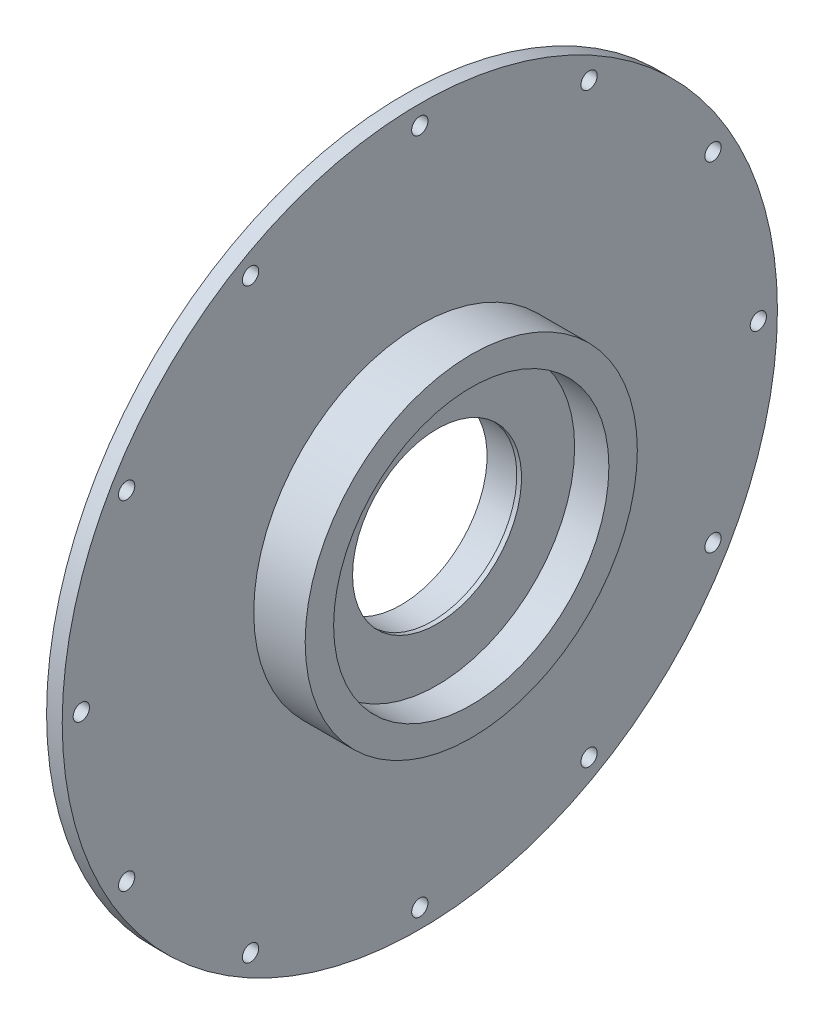
ISO-10303-21;
HEADER;
FILE_DESCRIPTION(('STEP AP214'),'2;1');
FILE_NAME('part.step','',(''),(''),'','','');
FILE_SCHEMA(('AUTOMOTIVE_DESIGN { 1 0 10303 214 1 1 1 1 }'));
ENDSEC;
DATA;
#1=APPLICATION_CONTEXT('core data for automotive mechanical design processes');
#2=APPLICATION_PROTOCOL_DEFINITION('international standard','automotive_design',2000,#1);
#3=PRODUCT_CONTEXT('',#1,'mechanical');
#4=PRODUCT('Part','Part','',(#3));
#5=PRODUCT_RELATED_PRODUCT_CATEGORY('part','',(#4));
#6=PRODUCT_DEFINITION_FORMATION('','',#4);
#7=PRODUCT_DEFINITION_CONTEXT('part definition',#1,'design');
#8=PRODUCT_DEFINITION('design','',#6,#7);
#9=PRODUCT_DEFINITION_SHAPE('','',#8);
#10=(LENGTH_UNIT() NAMED_UNIT(*) SI_UNIT(.MILLI.,.METRE.));
#11=(NAMED_UNIT(*) PLANE_ANGLE_UNIT() SI_UNIT($,.RADIAN.));
#12=(NAMED_UNIT(*) SI_UNIT($,.STERADIAN.) SOLID_ANGLE_UNIT());
#13=UNCERTAINTY_MEASURE_WITH_UNIT(LENGTH_MEASURE(1.E-05),#10,'distance_accuracy_value','');
#14=(GEOMETRIC_REPRESENTATION_CONTEXT(3) GLOBAL_UNCERTAINTY_ASSIGNED_CONTEXT((#13)) GLOBAL_UNIT_ASSIGNED_CONTEXT((#10,
#11,#12)) REPRESENTATION_CONTEXT('',''));
#15=CARTESIAN_POINT('',(0.,0.,0.));
#16=DIRECTION('',(0.,0.,1.));
#17=DIRECTION('',(1.,0.,0.));
#18=AXIS2_PLACEMENT_3D('',#15,#16,#17);
#19=CARTESIAN_POINT('',(0.,27.5,0.));
#20=DIRECTION('',(1.,0.,0.));
#21=DIRECTION('',(0.,0.,-1.));
#22=AXIS2_PLACEMENT_3D('',#19,#20,#21);
#23=PLANE('',#22);
#24=CARTESIAN_POINT('',(0.,0.,0.));
#25=DIRECTION('',(-1.,0.,0.));
#26=DIRECTION('',(0.,0.,1.));
#27=AXIS2_PLACEMENT_3D('',#24,#25,#26);
#28=CIRCLE('',#27,27.5);
#29=CARTESIAN_POINT('',(0.,0.,27.5));
#30=VERTEX_POINT('',#29);
#31=EDGE_CURVE('E124',#30,#30,#28,.T.);
#32=ORIENTED_EDGE('',*,*,#31,.F.);
#33=EDGE_LOOP('',(#32));
#34=FACE_BOUND('',#33,.T.);
#35=CARTESIAN_POINT('',(0.,0.,0.));
#36=DIRECTION('',(-1.,0.,0.));
#37=DIRECTION('',(0.,0.,1.));
#38=AXIS2_PLACEMENT_3D('',#35,#36,#37);
#39=CIRCLE('',#38,35.2294888080078);
#40=CARTESIAN_POINT('',(0.,0.,35.2294888080078));
#41=VERTEX_POINT('',#40);
#42=EDGE_CURVE('E10',#41,#41,#39,.T.);
#43=ORIENTED_EDGE('',*,*,#42,.T.);
#44=EDGE_LOOP('',(#43));
#45=FACE_BOUND('',#44,.T.);
#46=ADVANCED_FACE('F36',(#34,#45),#23,.F.);
#47=CARTESIAN_POINT('',(4.99999999999999,0.,0.));
#48=DIRECTION('',(1.,0.,0.));
#49=DIRECTION('',(0.,0.,-1.));
#50=AXIS2_PLACEMENT_3D('',#47,#48,#49);
#51=CONICAL_SURFACE('',#50,73.23,1.43997067062973);
#52=ORIENTED_EDGE('',*,*,#42,.F.);
#53=EDGE_LOOP('',(#52));
#54=FACE_BOUND('',#53,.T.);
#55=CARTESIAN_POINT('',(4.99999999999999,0.,0.));
#56=DIRECTION('',(-1.,0.,0.));
#57=DIRECTION('',(0.,0.,1.));
#58=AXIS2_PLACEMENT_3D('',#55,#56,#57);
#59=CIRCLE('',#58,73.23);
#60=CARTESIAN_POINT('',(4.99999999999999,0.,73.23));
#61=VERTEX_POINT('',#60);
#62=EDGE_CURVE('E44',#61,#61,#59,.T.);
#63=ORIENTED_EDGE('',*,*,#62,.T.);
#64=EDGE_LOOP('',(#63));
#65=FACE_BOUND('',#64,.T.);
#66=ADVANCED_FACE('F303',(#54,#65),#51,.T.);
#67=CARTESIAN_POINT('',(4.99999999999999,98.23,0.));
#68=DIRECTION('',(1.,0.,0.));
#69=DIRECTION('',(0.,0.,-1.));
#70=AXIS2_PLACEMENT_3D('',#67,#68,#69);
#71=PLANE('',#70);
#72=ORIENTED_EDGE('',*,*,#62,.F.);
#73=EDGE_LOOP('',(#72));
#74=FACE_BOUND('',#73,.T.);
#75=CARTESIAN_POINT('',(4.99999999999999,0.,0.));
#76=DIRECTION('',(-1.,0.,0.));
#77=DIRECTION('',(0.,0.,1.));
#78=AXIS2_PLACEMENT_3D('',#75,#76,#77);
#79=CIRCLE('',#78,98.23);
#80=CARTESIAN_POINT('',(4.99999999999999,0.,98.23));
#81=VERTEX_POINT('',#80);
#82=EDGE_CURVE('E50',#81,#81,#79,.T.);
#83=ORIENTED_EDGE('',*,*,#82,.T.);
#84=EDGE_LOOP('',(#83));
#85=FACE_BOUND('',#84,.T.);
#86=ADVANCED_FACE('F195',(#74,#85),#71,.F.);
#87=CARTESIAN_POINT('',(2.49999999999999,0.,0.));
#88=DIRECTION('',(-1.,0.,0.));
#89=DIRECTION('',(0.,0.,1.));
#90=AXIS2_PLACEMENT_3D('',#87,#88,#89);
#91=CONICAL_SURFACE('',#90,100.5,0.737217450629854);
#92=ORIENTED_EDGE('',*,*,#82,.F.);
#93=EDGE_LOOP('',(#92));
#94=FACE_BOUND('',#93,.T.);
#95=CARTESIAN_POINT('',(2.49999999999999,0.,0.));
#96=DIRECTION('',(-1.,0.,0.));
#97=DIRECTION('',(0.,0.,1.));
#98=AXIS2_PLACEMENT_3D('',#95,#96,#97);
#99=CIRCLE('',#98,100.5);
#100=CARTESIAN_POINT('',(2.49999999999999,0.,100.5));
#101=VERTEX_POINT('',#100);
#102=EDGE_CURVE('E188',#101,#101,#99,.T.);
#103=ORIENTED_EDGE('',*,*,#102,.T.);
#104=EDGE_LOOP('',(#103));
#105=FACE_BOUND('',#104,.T.);
#106=ADVANCED_FACE('F197',(#94,#105),#91,.F.);
#107=CARTESIAN_POINT('',(0.,0.,0.));
#108=DIRECTION('',(-1.,0.,0.));
#109=DIRECTION('',(0.,0.,1.));
#110=AXIS2_PLACEMENT_3D('',#107,#108,#109);
#111=CYLINDRICAL_SURFACE('',#110,100.5);
#112=ORIENTED_EDGE('',*,*,#102,.F.);
#113=EDGE_LOOP('',(#112));
#114=FACE_BOUND('',#113,.T.);
#115=CARTESIAN_POINT('',(-0.500000000000009,0.,0.));
#116=DIRECTION('',(-1.,0.,0.));
#117=DIRECTION('',(0.,0.,1.));
#118=AXIS2_PLACEMENT_3D('',#115,#116,#117);
#119=CIRCLE('',#118,100.5);
#120=CARTESIAN_POINT('',(-0.500000000000009,0.,100.5));
#121=VERTEX_POINT('',#120);
#122=EDGE_CURVE('E184',#121,#121,#119,.T.);
#123=ORIENTED_EDGE('',*,*,#122,.T.);
#124=EDGE_LOOP('',(#123));
#125=FACE_BOUND('',#124,.T.);
#126=ADVANCED_FACE('F200',(#114,#125),#111,.F.);
#127=CARTESIAN_POINT('',(-0.500000000000009,102.2,0.));
#128=DIRECTION('',(1.,0.,0.));
#129=DIRECTION('',(0.,0.,-1.));
#130=AXIS2_PLACEMENT_3D('',#127,#128,#129);
#131=PLANE('',#130);
#132=ORIENTED_EDGE('',*,*,#122,.F.);
#133=EDGE_LOOP('',(#132));
#134=FACE_BOUND('',#133,.T.);
#135=CARTESIAN_POINT('',(-0.500000000000009,0.,0.));
#136=DIRECTION('',(-1.,0.,0.));
#137=DIRECTION('',(0.,0.,1.));
#138=AXIS2_PLACEMENT_3D('',#135,#136,#137);
#139=CIRCLE('',#138,102.2);
#140=CARTESIAN_POINT('',(-0.500000000000009,0.,102.2));
#141=VERTEX_POINT('',#140);
#142=EDGE_CURVE('E180',#141,#141,#139,.T.);
#143=ORIENTED_EDGE('',*,*,#142,.T.);
#144=EDGE_LOOP('',(#143));
#145=FACE_BOUND('',#144,.T.);
#146=ADVANCED_FACE('F206',(#134,#145),#131,.F.);
#147=CARTESIAN_POINT('',(0.499999999999991,0.,0.));
#148=DIRECTION('',(1.,0.,0.));
#149=DIRECTION('',(0.,0.,-1.));
#150=AXIS2_PLACEMENT_3D('',#147,#148,#149);
#151=CONICAL_SURFACE('',#150,102.5,0.291456794477862);
#152=ORIENTED_EDGE('',*,*,#142,.F.);
#153=EDGE_LOOP('',(#152));
#154=FACE_BOUND('',#153,.T.);
#155=CARTESIAN_POINT('',(0.499999999999991,0.,0.));
#156=DIRECTION('',(-1.,0.,0.));
#157=DIRECTION('',(0.,0.,1.));
#158=AXIS2_PLACEMENT_3D('',#155,#156,#157);
#159=CIRCLE('',#158,102.5);
#160=CARTESIAN_POINT('',(0.499999999999991,0.,102.5));
#161=VERTEX_POINT('',#160);
#162=EDGE_CURVE('E176',#161,#161,#159,.T.);
#163=ORIENTED_EDGE('',*,*,#162,.T.);
#164=EDGE_LOOP('',(#163));
#165=FACE_BOUND('',#164,.T.);
#166=ADVANCED_FACE('F212',(#154,#165),#151,.T.);
#167=CARTESIAN_POINT('',(0.,0.,0.));
#168=DIRECTION('',(-1.,0.,0.));
#169=DIRECTION('',(0.,0.,1.));
#170=AXIS2_PLACEMENT_3D('',#167,#168,#169);
#171=CYLINDRICAL_SURFACE('',#170,102.5);
#172=ORIENTED_EDGE('',*,*,#162,.F.);
#173=EDGE_LOOP('',(#172));
#174=FACE_BOUND('',#173,.T.);
#175=CARTESIAN_POINT('',(2.49999999999999,0.,0.));
#176=DIRECTION('',(-1.,0.,0.));
#177=DIRECTION('',(0.,0.,1.));
#178=AXIS2_PLACEMENT_3D('',#175,#176,#177);
#179=CIRCLE('',#178,102.5);
#180=CARTESIAN_POINT('',(2.49999999999999,0.,102.5));
#181=VERTEX_POINT('',#180);
#182=EDGE_CURVE('E172',#181,#181,#179,.T.);
#183=ORIENTED_EDGE('',*,*,#182,.T.);
#184=EDGE_LOOP('',(#183));
#185=FACE_BOUND('',#184,.T.);
#186=ADVANCED_FACE('F218',(#174,#185),#171,.T.);
#187=CARTESIAN_POINT('',(2.49999999999999,102.5,0.));
#188=DIRECTION('',(1.,0.,0.));
#189=DIRECTION('',(0.,0.,-1.));
#190=AXIS2_PLACEMENT_3D('',#187,#188,#189);
#191=PLANE('',#190);
#192=ORIENTED_EDGE('',*,*,#182,.F.);
#193=EDGE_LOOP('',(#192));
#194=FACE_BOUND('',#193,.T.);
#195=CARTESIAN_POINT('',(2.49999999999999,0.,0.));
#196=DIRECTION('',(-1.,0.,0.));
#197=DIRECTION('',(0.,0.,1.));
#198=AXIS2_PLACEMENT_3D('',#195,#196,#197);
#199=CIRCLE('',#198,104.);
#200=CARTESIAN_POINT('',(2.49999999999999,0.,104.));
#201=VERTEX_POINT('',#200);
#202=EDGE_CURVE('E168',#201,#201,#199,.T.);
#203=ORIENTED_EDGE('',*,*,#202,.T.);
#204=EDGE_LOOP('',(#203));
#205=FACE_BOUND('',#204,.T.);
#206=ADVANCED_FACE('F224',(#194,#205),#191,.F.);
#207=CARTESIAN_POINT('',(0.,0.,0.));
#208=DIRECTION('',(-1.,0.,0.));
#209=DIRECTION('',(0.,0.,1.));
#210=AXIS2_PLACEMENT_3D('',#207,#208,#209);
#211=CYLINDRICAL_SURFACE('',#210,104.);
#212=ORIENTED_EDGE('',*,*,#202,.F.);
#213=EDGE_LOOP('',(#212));
#214=FACE_BOUND('',#213,.T.);
#215=CARTESIAN_POINT('',(0.99999999999999,0.,0.));
#216=DIRECTION('',(-1.,0.,0.));
#217=DIRECTION('',(0.,0.,1.));
#218=AXIS2_PLACEMENT_3D('',#215,#216,#217);
#219=CIRCLE('',#218,104.);
#220=CARTESIAN_POINT('',(0.99999999999999,0.,104.));
#221=VERTEX_POINT('',#220);
#222=EDGE_CURVE('E164',#221,#221,#219,.T.);
#223=ORIENTED_EDGE('',*,*,#222,.T.);
#224=EDGE_LOOP('',(#223));
#225=FACE_BOUND('',#224,.T.);
#226=ADVANCED_FACE('F230',(#214,#225),#211,.F.);
#227=CARTESIAN_POINT('',(0.99999999999999,104.,0.));
#228=DIRECTION('',(1.,0.,0.));
#229=DIRECTION('',(0.,0.,-1.));
#230=AXIS2_PLACEMENT_3D('',#227,#228,#229);
#231=PLANE('',#230);
#232=CARTESIAN_POINT('',(0.99999999999999,108.2,0.));
#233=DIRECTION('',(1.,0.,0.));
#234=DIRECTION('',(0.,0.,-1.));
#235=AXIS2_PLACEMENT_3D('',#232,#233,#234);
#236=CIRCLE('',#235,2.6);
#237=CARTESIAN_POINT('',(0.99999999999999,108.2,-2.6));
#238=VERTEX_POINT('',#237);
#239=EDGE_CURVE('E120',#238,#238,#236,.F.);
#240=ORIENTED_EDGE('',*,*,#239,.F.);
#241=EDGE_LOOP('',(#240));
#242=FACE_BOUND('',#241,.T.);
#243=CARTESIAN_POINT('',(0.99999999999999,93.7039486894732,54.0999999999992));
#244=DIRECTION('',(1.,0.,0.));
#245=DIRECTION('',(0.,0.,-1.));
#246=AXIS2_PLACEMENT_3D('',#243,#244,#245);
#247=CIRCLE('',#246,2.60000000000307);
#248=CARTESIAN_POINT('',(0.99999999999999,93.7039486894732,51.4999999999962));
#249=VERTEX_POINT('',#248);
#250=EDGE_CURVE('E106',#249,#249,#247,.F.);
#251=ORIENTED_EDGE('',*,*,#250,.F.);
#252=EDGE_LOOP('',(#251));
#253=FACE_BOUND('',#252,.T.);
#254=CARTESIAN_POINT('',(0.99999999999999,54.0999999999946,93.7039486894732));
#255=DIRECTION('',(1.,0.,0.));
#256=DIRECTION('',(0.,0.,-1.));
#257=AXIS2_PLACEMENT_3D('',#254,#255,#256);
#258=CIRCLE('',#257,2.60000000000576);
#259=CARTESIAN_POINT('',(0.99999999999999,54.0999999999946,91.1039486894675));
#260=VERTEX_POINT('',#259);
#261=EDGE_CURVE('E102',#260,#260,#258,.F.);
#262=ORIENTED_EDGE('',*,*,#261,.F.);
#263=EDGE_LOOP('',(#262));
#264=FACE_BOUND('',#263,.T.);
#265=CARTESIAN_POINT('',(0.99999999999999,-6.14383258155604E-12,108.199999999994));
#266=DIRECTION('',(1.,0.,0.));
#267=DIRECTION('',(0.,0.,-1.));
#268=AXIS2_PLACEMENT_3D('',#265,#266,#267);
#269=CIRCLE('',#268,2.60000000000875);
#270=CARTESIAN_POINT('',(0.99999999999999,-6.14383258155604E-12,105.599999999985));
#271=VERTEX_POINT('',#270);
#272=EDGE_CURVE('E98',#271,#271,#269,.F.);
#273=ORIENTED_EDGE('',*,*,#272,.F.);
#274=EDGE_LOOP('',(#273));
#275=FACE_BOUND('',#274,.T.);
#276=CARTESIAN_POINT('',(0.99999999999999,93.7039486894793,-54.1000000000008));
#277=DIRECTION('',(1.,0.,0.));
#278=DIRECTION('',(0.,0.,-1.));
#279=AXIS2_PLACEMENT_3D('',#276,#277,#278);
#280=CIRCLE('',#279,2.60000000000001);
#281=CARTESIAN_POINT('',(0.99999999999999,93.7039486894793,-56.7000000000008));
#282=VERTEX_POINT('',#281);
#283=EDGE_CURVE('E93',#282,#282,#280,.F.);
#284=ORIENTED_EDGE('',*,*,#283,.F.);
#285=EDGE_LOOP('',(#284));
#286=FACE_BOUND('',#285,.T.);
#287=CARTESIAN_POINT('',(0.99999999999999,54.1000000000053,-93.7039486894793));
#288=DIRECTION('',(1.,0.,0.));
#289=DIRECTION('',(0.,0.,-1.));
#290=AXIS2_PLACEMENT_3D('',#287,#288,#289);
#291=CIRCLE('',#290,2.60000000000162);
#292=CARTESIAN_POINT('',(0.99999999999999,54.1000000000053,-96.3039486894809));
#293=VERTEX_POINT('',#292);
#294=EDGE_CURVE('E88',#293,#293,#291,.F.);
#295=ORIENTED_EDGE('',*,*,#294,.F.);
#296=EDGE_LOOP('',(#295));
#297=FACE_BOUND('',#296,.T.);
#298=CARTESIAN_POINT('',(0.99999999999999,6.13058190318926E-12,-108.200000000006));
#299=DIRECTION('',(1.,0.,0.));
#300=DIRECTION('',(0.,0.,-1.));
#301=AXIS2_PLACEMENT_3D('',#298,#299,#300);
#302=CIRCLE('',#301,2.60000000000444);
#303=CARTESIAN_POINT('',(0.99999999999999,6.13058190318926E-12,-110.800000000011));
#304=VERTEX_POINT('',#303);
#305=EDGE_CURVE('E83',#304,#304,#302,.F.);
#306=ORIENTED_EDGE('',*,*,#305,.F.);
#307=EDGE_LOOP('',(#306));
#308=FACE_BOUND('',#307,.T.);
#309=CARTESIAN_POINT('',(0.99999999999999,-54.0999999999947,-93.7039486894855));
#310=DIRECTION('',(1.,0.,0.));
#311=DIRECTION('',(0.,0.,-1.));
#312=AXIS2_PLACEMENT_3D('',#309,#310,#311);
#313=CIRCLE('',#312,2.60000000000775);
#314=CARTESIAN_POINT('',(0.99999999999999,-54.0999999999947,-96.3039486894932));
#315=VERTEX_POINT('',#314);
#316=EDGE_CURVE('E78',#315,#315,#313,.F.);
#317=ORIENTED_EDGE('',*,*,#316,.F.);
#318=EDGE_LOOP('',(#317));
#319=FACE_BOUND('',#318,.T.);
#320=CARTESIAN_POINT('',(0.99999999999999,-93.7039486894732,-54.1000000000115));
#321=DIRECTION('',(1.,0.,0.));
#322=DIRECTION('',(0.,0.,-1.));
#323=AXIS2_PLACEMENT_3D('',#320,#321,#322);
#324=CIRCLE('',#323,2.60000000001069);
#325=CARTESIAN_POINT('',(0.99999999999999,-93.7039486894732,-56.7000000000222));
#326=VERTEX_POINT('',#325);
#327=EDGE_CURVE('E73',#326,#326,#324,.F.);
#328=ORIENTED_EDGE('',*,*,#327,.F.);
#329=EDGE_LOOP('',(#328));
#330=FACE_BOUND('',#329,.T.);
#331=CARTESIAN_POINT('',(0.99999999999999,-108.2,-1.22611638063785E-11));
#332=DIRECTION('',(1.,0.,0.));
#333=DIRECTION('',(0.,0.,-1.));
#334=AXIS2_PLACEMENT_3D('',#331,#332,#333);
#335=CIRCLE('',#334,2.60000000001245);
#336=CARTESIAN_POINT('',(0.99999999999999,-108.2,-2.60000000002471));
#337=VERTEX_POINT('',#336);
#338=EDGE_CURVE('E68',#337,#337,#335,.F.);
#339=ORIENTED_EDGE('',*,*,#338,.F.);
#340=EDGE_LOOP('',(#339));
#341=FACE_BOUND('',#340,.T.);
#342=CARTESIAN_POINT('',(0.99999999999999,-93.7039486894793,54.0999999999885));
#343=DIRECTION('',(1.,0.,0.));
#344=DIRECTION('',(0.,0.,-1.));
#345=AXIS2_PLACEMENT_3D('',#342,#343,#344);
#346=CIRCLE('',#345,2.60000000001271);
#347=CARTESIAN_POINT('',(0.99999999999999,-93.7039486894793,51.4999999999758));
#348=VERTEX_POINT('',#347);
#349=EDGE_CURVE('E63',#348,#348,#346,.F.);
#350=ORIENTED_EDGE('',*,*,#349,.F.);
#351=EDGE_LOOP('',(#350));
#352=FACE_BOUND('',#351,.T.);
#353=CARTESIAN_POINT('',(0.99999999999999,-54.1000000000053,93.7039486894671));
#354=DIRECTION('',(1.,0.,0.));
#355=DIRECTION('',(0.,0.,-1.));
#356=AXIS2_PLACEMENT_3D('',#353,#354,#355);
#357=CIRCLE('',#356,2.60000000001133);
#358=CARTESIAN_POINT('',(0.99999999999999,-54.1000000000053,91.1039486894557));
#359=VERTEX_POINT('',#358);
#360=EDGE_CURVE('E58',#359,#359,#357,.F.);
#361=ORIENTED_EDGE('',*,*,#360,.F.);
#362=EDGE_LOOP('',(#361));
#363=FACE_BOUND('',#362,.T.);
#364=ORIENTED_EDGE('',*,*,#222,.F.);
#365=EDGE_LOOP('',(#364));
#366=FACE_BOUND('',#365,.T.);
#367=CARTESIAN_POINT('',(0.99999999999999,0.,0.));
#368=DIRECTION('',(-1.,0.,0.));
#369=DIRECTION('',(0.,0.,1.));
#370=AXIS2_PLACEMENT_3D('',#367,#368,#369);
#371=CIRCLE('',#370,114.3);
#372=CARTESIAN_POINT('',(0.99999999999999,0.,114.3));
#373=VERTEX_POINT('',#372);
#374=EDGE_CURVE('E160',#373,#373,#371,.T.);
#375=ORIENTED_EDGE('',*,*,#374,.T.);
#376=EDGE_LOOP('',(#375));
#377=FACE_BOUND('',#376,.T.);
#378=ADVANCED_FACE('F236',(#242,#253,#264,#275,#286,#297,#308,#319,#330,#341,#352,#363,#366,
#377),#231,.F.);
#379=CARTESIAN_POINT('',(0.,0.,0.));
#380=DIRECTION('',(-1.,0.,0.));
#381=DIRECTION('',(0.,0.,1.));
#382=AXIS2_PLACEMENT_3D('',#379,#380,#381);
#383=CYLINDRICAL_SURFACE('',#382,114.3);
#384=ORIENTED_EDGE('',*,*,#374,.F.);
#385=EDGE_LOOP('',(#384));
#386=FACE_BOUND('',#385,.T.);
#387=CARTESIAN_POINT('',(5.99999999999999,0.,0.));
#388=DIRECTION('',(-1.,0.,0.));
#389=DIRECTION('',(0.,0.,1.));
#390=AXIS2_PLACEMENT_3D('',#387,#388,#389);
#391=CIRCLE('',#390,114.3);
#392=CARTESIAN_POINT('',(5.99999999999999,0.,114.3));
#393=VERTEX_POINT('',#392);
#394=EDGE_CURVE('E156',#393,#393,#391,.T.);
#395=ORIENTED_EDGE('',*,*,#394,.T.);
#396=EDGE_LOOP('',(#395));
#397=FACE_BOUND('',#396,.T.);
#398=ADVANCED_FACE('F242',(#386,#397),#383,.T.);
#399=CARTESIAN_POINT('',(5.99999999999999,53.0840235504504,0.));
#400=DIRECTION('',(-1.,0.,0.));
#401=DIRECTION('',(0.,0.,1.));
#402=AXIS2_PLACEMENT_3D('',#399,#400,#401);
#403=PLANE('',#402);
#404=CARTESIAN_POINT('',(5.99999999999999,108.2,0.));
#405=DIRECTION('',(-1.,0.,0.));
#406=DIRECTION('',(0.,0.,1.));
#407=AXIS2_PLACEMENT_3D('',#404,#405,#406);
#408=CIRCLE('',#407,2.6);
#409=CARTESIAN_POINT('',(5.99999999999999,108.2,2.6));
#410=VERTEX_POINT('',#409);
#411=EDGE_CURVE('E39',#410,#410,#408,.F.);
#412=ORIENTED_EDGE('',*,*,#411,.F.);
#413=EDGE_LOOP('',(#412));
#414=FACE_BOUND('',#413,.T.);
#415=CARTESIAN_POINT('',(5.99999999999999,93.7039486894732,54.0999999999992));
#416=DIRECTION('',(-1.,0.,0.));
#417=DIRECTION('',(0.,0.,1.));
#418=AXIS2_PLACEMENT_3D('',#415,#416,#417);
#419=CIRCLE('',#418,2.60000000000307);
#420=CARTESIAN_POINT('',(5.99999999999999,93.7039486894732,56.7000000000023));
#421=VERTEX_POINT('',#420);
#422=EDGE_CURVE('E103',#421,#421,#419,.F.);
#423=ORIENTED_EDGE('',*,*,#422,.F.);
#424=EDGE_LOOP('',(#423));
#425=FACE_BOUND('',#424,.T.);
#426=CARTESIAN_POINT('',(5.99999999999999,54.0999999999946,93.7039486894732));
#427=DIRECTION('',(-1.,0.,0.));
#428=DIRECTION('',(0.,0.,1.));
#429=AXIS2_PLACEMENT_3D('',#426,#427,#428);
#430=CIRCLE('',#429,2.60000000000576);
#431=CARTESIAN_POINT('',(5.99999999999999,54.0999999999946,96.303948689479));
#432=VERTEX_POINT('',#431);
#433=EDGE_CURVE('E99',#432,#432,#430,.F.);
#434=ORIENTED_EDGE('',*,*,#433,.F.);
#435=EDGE_LOOP('',(#434));
#436=FACE_BOUND('',#435,.T.);
#437=CARTESIAN_POINT('',(5.99999999999999,-6.14383258155604E-12,108.199999999994));
#438=DIRECTION('',(-1.,0.,0.));
#439=DIRECTION('',(0.,0.,1.));
#440=AXIS2_PLACEMENT_3D('',#437,#438,#439);
#441=CIRCLE('',#440,2.60000000000875);
#442=CARTESIAN_POINT('',(5.99999999999999,-6.14383258155604E-12,110.800000000003));
#443=VERTEX_POINT('',#442);
#444=EDGE_CURVE('E94',#443,#443,#441,.F.);
#445=ORIENTED_EDGE('',*,*,#444,.F.);
#446=EDGE_LOOP('',(#445));
#447=FACE_BOUND('',#446,.T.);
#448=CARTESIAN_POINT('',(5.99999999999999,93.7039486894793,-54.1000000000008));
#449=DIRECTION('',(-1.,0.,0.));
#450=DIRECTION('',(0.,0.,1.));
#451=AXIS2_PLACEMENT_3D('',#448,#449,#450);
#452=CIRCLE('',#451,2.60000000000001);
#453=CARTESIAN_POINT('',(5.99999999999999,93.7039486894793,-51.5000000000008));
#454=VERTEX_POINT('',#453);
#455=EDGE_CURVE('E89',#454,#454,#452,.F.);
#456=ORIENTED_EDGE('',*,*,#455,.F.);
#457=EDGE_LOOP('',(#456));
#458=FACE_BOUND('',#457,.T.);
#459=CARTESIAN_POINT('',(5.99999999999999,54.1000000000053,-93.7039486894793));
#460=DIRECTION('',(-1.,0.,0.));
#461=DIRECTION('',(0.,0.,1.));
#462=AXIS2_PLACEMENT_3D('',#459,#460,#461);
#463=CIRCLE('',#462,2.60000000000162);
#464=CARTESIAN_POINT('',(5.99999999999999,54.1000000000053,-91.1039486894777));
#465=VERTEX_POINT('',#464);
#466=EDGE_CURVE('E84',#465,#465,#463,.F.);
#467=ORIENTED_EDGE('',*,*,#466,.F.);
#468=EDGE_LOOP('',(#467));
#469=FACE_BOUND('',#468,.T.);
#470=CARTESIAN_POINT('',(5.99999999999999,6.13058190318926E-12,-108.200000000006));
#471=DIRECTION('',(-1.,0.,0.));
#472=DIRECTION('',(0.,0.,1.));
#473=AXIS2_PLACEMENT_3D('',#470,#471,#472);
#474=CIRCLE('',#473,2.60000000000444);
#475=CARTESIAN_POINT('',(5.99999999999999,6.13058190318926E-12,-105.600000000002));
#476=VERTEX_POINT('',#475);
#477=EDGE_CURVE('E79',#476,#476,#474,.F.);
#478=ORIENTED_EDGE('',*,*,#477,.F.);
#479=EDGE_LOOP('',(#478));
#480=FACE_BOUND('',#479,.T.);
#481=CARTESIAN_POINT('',(5.99999999999999,-54.0999999999947,-93.7039486894855));
#482=DIRECTION('',(-1.,0.,0.));
#483=DIRECTION('',(0.,0.,1.));
#484=AXIS2_PLACEMENT_3D('',#481,#482,#483);
#485=CIRCLE('',#484,2.60000000000775);
#486=CARTESIAN_POINT('',(5.99999999999999,-54.0999999999947,-91.1039486894777));
#487=VERTEX_POINT('',#486);
#488=EDGE_CURVE('E74',#487,#487,#485,.F.);
#489=ORIENTED_EDGE('',*,*,#488,.F.);
#490=EDGE_LOOP('',(#489));
#491=FACE_BOUND('',#490,.T.);
#492=CARTESIAN_POINT('',(5.99999999999999,-93.7039486894732,-54.1000000000115));
#493=DIRECTION('',(-1.,0.,0.));
#494=DIRECTION('',(0.,0.,1.));
#495=AXIS2_PLACEMENT_3D('',#492,#493,#494);
#496=CIRCLE('',#495,2.60000000001069);
#497=CARTESIAN_POINT('',(5.99999999999999,-93.7039486894732,-51.5000000000008));
#498=VERTEX_POINT('',#497);
#499=EDGE_CURVE('E69',#498,#498,#496,.F.);
#500=ORIENTED_EDGE('',*,*,#499,.F.);
#501=EDGE_LOOP('',(#500));
#502=FACE_BOUND('',#501,.T.);
#503=CARTESIAN_POINT('',(5.99999999999999,-108.2,-1.22611638063785E-11));
#504=DIRECTION('',(-1.,0.,0.));
#505=DIRECTION('',(0.,0.,1.));
#506=AXIS2_PLACEMENT_3D('',#503,#504,#505);
#507=CIRCLE('',#506,2.60000000001245);
#508=CARTESIAN_POINT('',(5.99999999999999,-108.2,2.60000000000019));
#509=VERTEX_POINT('',#508);
#510=EDGE_CURVE('E64',#509,#509,#507,.F.);
#511=ORIENTED_EDGE('',*,*,#510,.F.);
#512=EDGE_LOOP('',(#511));
#513=FACE_BOUND('',#512,.T.);
#514=CARTESIAN_POINT('',(5.99999999999999,-93.7039486894793,54.0999999999885));
#515=DIRECTION('',(-1.,0.,0.));
#516=DIRECTION('',(0.,0.,1.));
#517=AXIS2_PLACEMENT_3D('',#514,#515,#516);
#518=CIRCLE('',#517,2.60000000001271);
#519=CARTESIAN_POINT('',(5.99999999999999,-93.7039486894793,56.7000000000012));
#520=VERTEX_POINT('',#519);
#521=EDGE_CURVE('E59',#520,#520,#518,.F.);
#522=ORIENTED_EDGE('',*,*,#521,.F.);
#523=EDGE_LOOP('',(#522));
#524=FACE_BOUND('',#523,.T.);
#525=CARTESIAN_POINT('',(5.99999999999999,-54.1000000000053,93.7039486894671));
#526=DIRECTION('',(-1.,0.,0.));
#527=DIRECTION('',(0.,0.,1.));
#528=AXIS2_PLACEMENT_3D('',#525,#526,#527);
#529=CIRCLE('',#528,2.60000000001133);
#530=CARTESIAN_POINT('',(5.99999999999999,-54.1000000000053,96.3039486894784));
#531=VERTEX_POINT('',#530);
#532=EDGE_CURVE('E54',#531,#531,#529,.F.);
#533=ORIENTED_EDGE('',*,*,#532,.F.);
#534=EDGE_LOOP('',(#533));
#535=FACE_BOUND('',#534,.T.);
#536=ORIENTED_EDGE('',*,*,#394,.F.);
#537=EDGE_LOOP('',(#536));
#538=FACE_BOUND('',#537,.T.);
#539=CARTESIAN_POINT('',(5.99999999999999,0.,0.));
#540=DIRECTION('',(-1.,0.,0.));
#541=DIRECTION('',(0.,0.,1.));
#542=AXIS2_PLACEMENT_3D('',#539,#540,#541);
#543=CIRCLE('',#542,53.0840235504504);
#544=CARTESIAN_POINT('',(5.99999999999999,0.,53.0840235504504));
#545=VERTEX_POINT('',#544);
#546=EDGE_CURVE('E152',#545,#545,#543,.T.);
#547=ORIENTED_EDGE('',*,*,#546,.T.);
#548=EDGE_LOOP('',(#547));
#549=FACE_BOUND('',#548,.T.);
#550=ADVANCED_FACE('F249',(#414,#425,#436,#447,#458,#469,#480,#491,#502,#513,#524,#535,#538,
#549),#403,.F.);
#551=CARTESIAN_POINT('',(0.,0.,0.));
#552=DIRECTION('',(-1.,0.,0.));
#553=DIRECTION('',(0.,0.,1.));
#554=AXIS2_PLACEMENT_3D('',#551,#552,#553);
#555=CYLINDRICAL_SURFACE('',#554,53.0840235504504);
#556=ORIENTED_EDGE('',*,*,#546,.F.);
#557=EDGE_LOOP('',(#556));
#558=FACE_BOUND('',#557,.T.);
#559=CARTESIAN_POINT('',(22.4363743155159,0.,0.));
#560=DIRECTION('',(-1.,0.,0.));
#561=DIRECTION('',(0.,0.,1.));
#562=AXIS2_PLACEMENT_3D('',#559,#560,#561);
#563=CIRCLE('',#562,53.0840235504504);
#564=CARTESIAN_POINT('',(22.4363743155159,0.,53.0840235504504));
#565=VERTEX_POINT('',#564);
#566=EDGE_CURVE('E148',#565,#565,#563,.T.);
#567=ORIENTED_EDGE('',*,*,#566,.T.);
#568=EDGE_LOOP('',(#567));
#569=FACE_BOUND('',#568,.T.);
#570=ADVANCED_FACE('F255',(#558,#569),#555,.T.);
#571=CARTESIAN_POINT('',(22.4363743155159,43.9890328989032,0.));
#572=DIRECTION('',(-1.,0.,0.));
#573=DIRECTION('',(0.,0.,1.));
#574=AXIS2_PLACEMENT_3D('',#571,#572,#573);
#575=PLANE('',#574);
#576=ORIENTED_EDGE('',*,*,#566,.F.);
#577=EDGE_LOOP('',(#576));
#578=FACE_BOUND('',#577,.T.);
#579=CARTESIAN_POINT('',(22.4363743155159,0.,0.));
#580=DIRECTION('',(-1.,0.,0.));
#581=DIRECTION('',(0.,0.,1.));
#582=AXIS2_PLACEMENT_3D('',#579,#580,#581);
#583=CIRCLE('',#582,43.9890328989032);
#584=CARTESIAN_POINT('',(22.4363743155159,0.,43.9890328989032));
#585=VERTEX_POINT('',#584);
#586=EDGE_CURVE('E144',#585,#585,#583,.T.);
#587=ORIENTED_EDGE('',*,*,#586,.T.);
#588=EDGE_LOOP('',(#587));
#589=FACE_BOUND('',#588,.T.);
#590=ADVANCED_FACE('F262',(#578,#589),#575,.F.);
#591=CARTESIAN_POINT('',(0.,0.,0.));
#592=DIRECTION('',(-1.,0.,0.));
#593=DIRECTION('',(0.,0.,1.));
#594=AXIS2_PLACEMENT_3D('',#591,#592,#593);
#595=CYLINDRICAL_SURFACE('',#594,43.9890328989032);
#596=ORIENTED_EDGE('',*,*,#586,.F.);
#597=EDGE_LOOP('',(#596));
#598=FACE_BOUND('',#597,.T.);
#599=CARTESIAN_POINT('',(11.5,0.,0.));
#600=DIRECTION('',(-1.,0.,0.));
#601=DIRECTION('',(0.,0.,1.));
#602=AXIS2_PLACEMENT_3D('',#599,#600,#601);
#603=CIRCLE('',#602,43.9890328989032);
#604=CARTESIAN_POINT('',(11.5,0.,43.9890328989032));
#605=VERTEX_POINT('',#604);
#606=EDGE_CURVE('E140',#605,#605,#603,.T.);
#607=ORIENTED_EDGE('',*,*,#606,.T.);
#608=EDGE_LOOP('',(#607));
#609=FACE_BOUND('',#608,.T.);
#610=ADVANCED_FACE('F268',(#598,#609),#595,.F.);
#611=CARTESIAN_POINT('',(11.5,27.,0.));
#612=DIRECTION('',(-1.,0.,0.));
#613=DIRECTION('',(0.,0.,1.));
#614=AXIS2_PLACEMENT_3D('',#611,#612,#613);
#615=PLANE('',#614);
#616=ORIENTED_EDGE('',*,*,#606,.F.);
#617=EDGE_LOOP('',(#616));
#618=FACE_BOUND('',#617,.T.);
#619=CARTESIAN_POINT('',(11.5,0.,0.));
#620=DIRECTION('',(-1.,0.,0.));
#621=DIRECTION('',(0.,0.,1.));
#622=AXIS2_PLACEMENT_3D('',#619,#620,#621);
#623=CIRCLE('',#622,27.);
#624=CARTESIAN_POINT('',(11.5,0.,27.));
#625=VERTEX_POINT('',#624);
#626=EDGE_CURVE('E136',#625,#625,#623,.T.);
#627=ORIENTED_EDGE('',*,*,#626,.T.);
#628=EDGE_LOOP('',(#627));
#629=FACE_BOUND('',#628,.T.);
#630=ADVANCED_FACE('F274',(#618,#629),#615,.F.);
#631=CARTESIAN_POINT('',(0.,0.,0.));
#632=DIRECTION('',(-1.,0.,0.));
#633=DIRECTION('',(0.,0.,1.));
#634=AXIS2_PLACEMENT_3D('',#631,#632,#633);
#635=CYLINDRICAL_SURFACE('',#634,27.);
#636=ORIENTED_EDGE('',*,*,#626,.F.);
#637=EDGE_LOOP('',(#636));
#638=FACE_BOUND('',#637,.T.);
#639=CARTESIAN_POINT('',(10.,0.,0.));
#640=DIRECTION('',(-1.,0.,0.));
#641=DIRECTION('',(0.,0.,1.));
#642=AXIS2_PLACEMENT_3D('',#639,#640,#641);
#643=CIRCLE('',#642,27.);
#644=CARTESIAN_POINT('',(10.,0.,27.));
#645=VERTEX_POINT('',#644);
#646=EDGE_CURVE('E132',#645,#645,#643,.T.);
#647=ORIENTED_EDGE('',*,*,#646,.T.);
#648=EDGE_LOOP('',(#647));
#649=FACE_BOUND('',#648,.T.);
#650=ADVANCED_FACE('F280',(#638,#649),#635,.F.);
#651=CARTESIAN_POINT('',(10.,27.5,0.));
#652=DIRECTION('',(1.,0.,0.));
#653=DIRECTION('',(0.,0.,-1.));
#654=AXIS2_PLACEMENT_3D('',#651,#652,#653);
#655=PLANE('',#654);
#656=ORIENTED_EDGE('',*,*,#646,.F.);
#657=EDGE_LOOP('',(#656));
#658=FACE_BOUND('',#657,.T.);
#659=CARTESIAN_POINT('',(10.,0.,0.));
#660=DIRECTION('',(-1.,0.,0.));
#661=DIRECTION('',(0.,0.,1.));
#662=AXIS2_PLACEMENT_3D('',#659,#660,#661);
#663=CIRCLE('',#662,27.5);
#664=CARTESIAN_POINT('',(10.,0.,27.5));
#665=VERTEX_POINT('',#664);
#666=EDGE_CURVE('E128',#665,#665,#663,.T.);
#667=ORIENTED_EDGE('',*,*,#666,.T.);
#668=EDGE_LOOP('',(#667));
#669=FACE_BOUND('',#668,.T.);
#670=ADVANCED_FACE('F286',(#658,#669),#655,.F.);
#671=CARTESIAN_POINT('',(0.,0.,0.));
#672=DIRECTION('',(-1.,0.,0.));
#673=DIRECTION('',(0.,0.,1.));
#674=AXIS2_PLACEMENT_3D('',#671,#672,#673);
#675=CYLINDRICAL_SURFACE('',#674,27.5);
#676=ORIENTED_EDGE('',*,*,#666,.F.);
#677=EDGE_LOOP('',(#676));
#678=FACE_BOUND('',#677,.T.);
#679=ORIENTED_EDGE('',*,*,#31,.T.);
#680=EDGE_LOOP('',(#679));
#681=FACE_BOUND('',#680,.T.);
#682=ADVANCED_FACE('F292',(#678,#681),#675,.F.);
#683=CARTESIAN_POINT('',(10.,-54.1000000000053,93.7039486894671));
#684=DIRECTION('',(-1.,0.,0.));
#685=DIRECTION('',(0.,0.,1.));
#686=AXIS2_PLACEMENT_3D('',#683,#684,#685);
#687=CYLINDRICAL_SURFACE('',#686,2.60000000001133);
#688=ORIENTED_EDGE('',*,*,#532,.T.);
#689=EDGE_LOOP('',(#688));
#690=FACE_BOUND('',#689,.T.);
#691=ORIENTED_EDGE('',*,*,#360,.T.);
#692=EDGE_LOOP('',(#691));
#693=FACE_BOUND('',#692,.T.);
#694=ADVANCED_FACE('F298',(#690,#693),#687,.F.);
#695=CARTESIAN_POINT('',(10.,-93.7039486894793,54.0999999999885));
#696=DIRECTION('',(-1.,0.,0.));
#697=DIRECTION('',(0.,0.,1.));
#698=AXIS2_PLACEMENT_3D('',#695,#696,#697);
#699=CYLINDRICAL_SURFACE('',#698,2.60000000001271);
#700=ORIENTED_EDGE('',*,*,#521,.T.);
#701=EDGE_LOOP('',(#700));
#702=FACE_BOUND('',#701,.T.);
#703=ORIENTED_EDGE('',*,*,#349,.T.);
#704=EDGE_LOOP('',(#703));
#705=FACE_BOUND('',#704,.T.);
#706=ADVANCED_FACE('F335',(#702,#705),#699,.F.);
#707=CARTESIAN_POINT('',(10.,-108.2,-1.22611638063785E-11));
#708=DIRECTION('',(-1.,0.,0.));
#709=DIRECTION('',(0.,0.,1.));
#710=AXIS2_PLACEMENT_3D('',#707,#708,#709);
#711=CYLINDRICAL_SURFACE('',#710,2.60000000001245);
#712=ORIENTED_EDGE('',*,*,#510,.T.);
#713=EDGE_LOOP('',(#712));
#714=FACE_BOUND('',#713,.T.);
#715=ORIENTED_EDGE('',*,*,#338,.T.);
#716=EDGE_LOOP('',(#715));
#717=FACE_BOUND('',#716,.T.);
#718=ADVANCED_FACE('F339',(#714,#717),#711,.F.);
#719=CARTESIAN_POINT('',(10.,-93.7039486894732,-54.1000000000115));
#720=DIRECTION('',(-1.,0.,0.));
#721=DIRECTION('',(0.,0.,1.));
#722=AXIS2_PLACEMENT_3D('',#719,#720,#721);
#723=CYLINDRICAL_SURFACE('',#722,2.60000000001069);
#724=ORIENTED_EDGE('',*,*,#499,.T.);
#725=EDGE_LOOP('',(#724));
#726=FACE_BOUND('',#725,.T.);
#727=ORIENTED_EDGE('',*,*,#327,.T.);
#728=EDGE_LOOP('',(#727));
#729=FACE_BOUND('',#728,.T.);
#730=ADVANCED_FACE('F319',(#726,#729),#723,.F.);
#731=CARTESIAN_POINT('',(10.,-54.0999999999947,-93.7039486894855));
#732=DIRECTION('',(-1.,0.,0.));
#733=DIRECTION('',(0.,0.,1.));
#734=AXIS2_PLACEMENT_3D('',#731,#732,#733);
#735=CYLINDRICAL_SURFACE('',#734,2.60000000000775);
#736=ORIENTED_EDGE('',*,*,#488,.T.);
#737=EDGE_LOOP('',(#736));
#738=FACE_BOUND('',#737,.T.);
#739=ORIENTED_EDGE('',*,*,#316,.T.);
#740=EDGE_LOOP('',(#739));
#741=FACE_BOUND('',#740,.T.);
#742=ADVANCED_FACE('F315',(#738,#741),#735,.F.);
#743=CARTESIAN_POINT('',(10.,6.13058190318926E-12,-108.200000000006));
#744=DIRECTION('',(-1.,0.,0.));
#745=DIRECTION('',(0.,0.,1.));
#746=AXIS2_PLACEMENT_3D('',#743,#744,#745);
#747=CYLINDRICAL_SURFACE('',#746,2.60000000000444);
#748=ORIENTED_EDGE('',*,*,#477,.T.);
#749=EDGE_LOOP('',(#748));
#750=FACE_BOUND('',#749,.T.);
#751=ORIENTED_EDGE('',*,*,#305,.T.);
#752=EDGE_LOOP('',(#751));
#753=FACE_BOUND('',#752,.T.);
#754=ADVANCED_FACE('F318',(#750,#753),#747,.F.);
#755=CARTESIAN_POINT('',(10.,54.1000000000053,-93.7039486894793));
#756=DIRECTION('',(-1.,0.,0.));
#757=DIRECTION('',(0.,0.,1.));
#758=AXIS2_PLACEMENT_3D('',#755,#756,#757);
#759=CYLINDRICAL_SURFACE('',#758,2.60000000000162);
#760=ORIENTED_EDGE('',*,*,#466,.T.);
#761=EDGE_LOOP('',(#760));
#762=FACE_BOUND('',#761,.T.);
#763=ORIENTED_EDGE('',*,*,#294,.T.);
#764=EDGE_LOOP('',(#763));
#765=FACE_BOUND('',#764,.T.);
#766=ADVANCED_FACE('F323',(#762,#765),#759,.F.);
#767=CARTESIAN_POINT('',(10.,93.7039486894793,-54.1000000000008));
#768=DIRECTION('',(-1.,0.,0.));
#769=DIRECTION('',(0.,0.,1.));
#770=AXIS2_PLACEMENT_3D('',#767,#768,#769);
#771=CYLINDRICAL_SURFACE('',#770,2.60000000000001);
#772=ORIENTED_EDGE('',*,*,#455,.T.);
#773=EDGE_LOOP('',(#772));
#774=FACE_BOUND('',#773,.T.);
#775=ORIENTED_EDGE('',*,*,#283,.T.);
#776=EDGE_LOOP('',(#775));
#777=FACE_BOUND('',#776,.T.);
#778=ADVANCED_FACE('F327',(#774,#777),#771,.F.);
#779=CARTESIAN_POINT('',(10.,-6.14383258155604E-12,108.199999999994));
#780=DIRECTION('',(-1.,0.,0.));
#781=DIRECTION('',(0.,0.,1.));
#782=AXIS2_PLACEMENT_3D('',#779,#780,#781);
#783=CYLINDRICAL_SURFACE('',#782,2.60000000000875);
#784=ORIENTED_EDGE('',*,*,#444,.T.);
#785=EDGE_LOOP('',(#784));
#786=FACE_BOUND('',#785,.T.);
#787=ORIENTED_EDGE('',*,*,#272,.T.);
#788=EDGE_LOOP('',(#787));
#789=FACE_BOUND('',#788,.T.);
#790=ADVANCED_FACE('F331',(#786,#789),#783,.F.);
#791=CARTESIAN_POINT('',(10.,54.0999999999946,93.7039486894732));
#792=DIRECTION('',(-1.,0.,0.));
#793=DIRECTION('',(0.,0.,1.));
#794=AXIS2_PLACEMENT_3D('',#791,#792,#793);
#795=CYLINDRICAL_SURFACE('',#794,2.60000000000576);
#796=ORIENTED_EDGE('',*,*,#433,.T.);
#797=EDGE_LOOP('',(#796));
#798=FACE_BOUND('',#797,.T.);
#799=ORIENTED_EDGE('',*,*,#261,.T.);
#800=EDGE_LOOP('',(#799));
#801=FACE_BOUND('',#800,.T.);
#802=ADVANCED_FACE('F351',(#798,#801),#795,.F.);
#803=CARTESIAN_POINT('',(10.,93.7039486894732,54.0999999999992));
#804=DIRECTION('',(-1.,0.,0.));
#805=DIRECTION('',(0.,0.,1.));
#806=AXIS2_PLACEMENT_3D('',#803,#804,#805);
#807=CYLINDRICAL_SURFACE('',#806,2.60000000000307);
#808=ORIENTED_EDGE('',*,*,#422,.T.);
#809=EDGE_LOOP('',(#808));
#810=FACE_BOUND('',#809,.T.);
#811=ORIENTED_EDGE('',*,*,#250,.T.);
#812=EDGE_LOOP('',(#811));
#813=FACE_BOUND('',#812,.T.);
#814=ADVANCED_FACE('F347',(#810,#813),#807,.F.);
#815=CARTESIAN_POINT('',(10.,108.2,0.));
#816=DIRECTION('',(-1.,0.,0.));
#817=DIRECTION('',(0.,0.,1.));
#818=AXIS2_PLACEMENT_3D('',#815,#816,#817);
#819=CYLINDRICAL_SURFACE('',#818,2.6);
#820=ORIENTED_EDGE('',*,*,#411,.T.);
#821=EDGE_LOOP('',(#820));
#822=FACE_BOUND('',#821,.T.);
#823=ORIENTED_EDGE('',*,*,#239,.T.);
#824=EDGE_LOOP('',(#823));
#825=FACE_BOUND('',#824,.T.);
#826=ADVANCED_FACE('F350',(#822,#825),#819,.F.);
#827=CLOSED_SHELL('',(#46,#66,#86,#106,#126,#146,#166,#186,#206,#226,#378,#398,#550,#570,#590,
#610,#630,#650,#670,#682,#694,#706,#718,#730,#742,#754,#766,#778,#790,#802,#814,#826));
#828=MANIFOLD_SOLID_BREP('B2',#827);
#829=ADVANCED_BREP_SHAPE_REPRESENTATION('',(#18,#828),#14);
#830=SHAPE_DEFINITION_REPRESENTATION(#9,#829);
ENDSEC;
END-ISO-10303-21;
